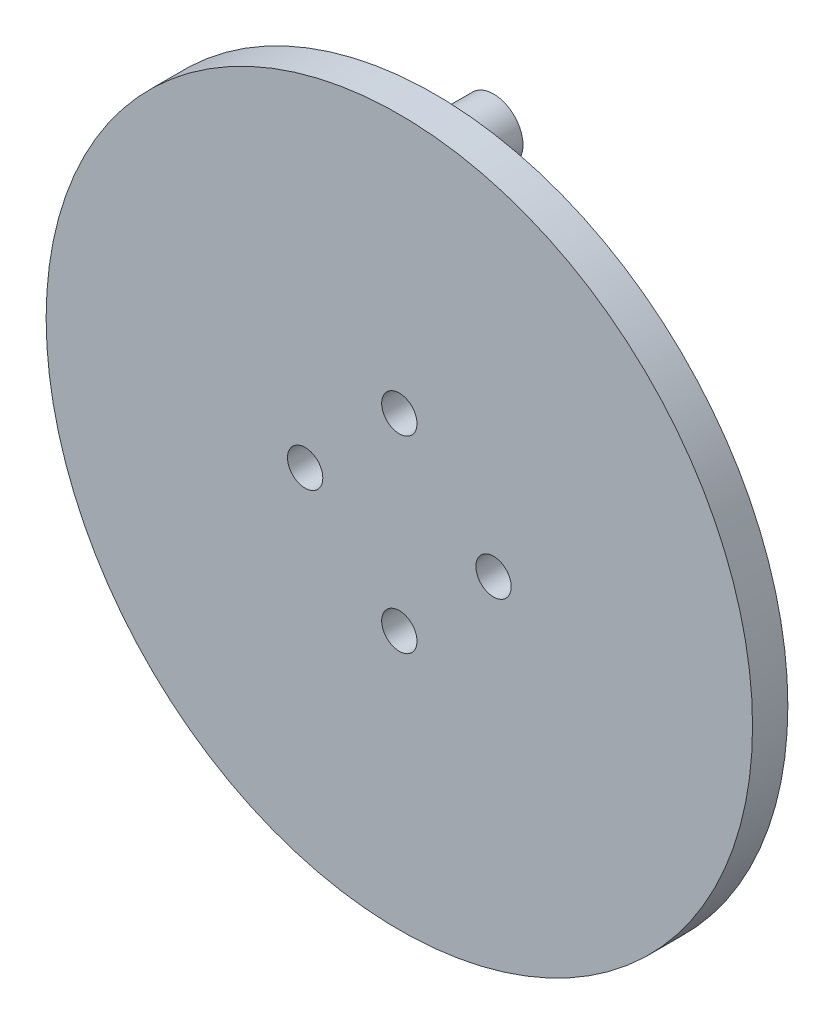
ISO-10303-21;
HEADER;
FILE_DESCRIPTION(('STEP AP214'),'2;1');
FILE_NAME('part.step','',(''),(''),'','','');
FILE_SCHEMA(('AUTOMOTIVE_DESIGN { 1 0 10303 214 1 1 1 1 }'));
ENDSEC;
DATA;
#1=APPLICATION_CONTEXT('core data for automotive mechanical design processes');
#2=APPLICATION_PROTOCOL_DEFINITION('international standard','automotive_design',2000,#1);
#3=PRODUCT_CONTEXT('',#1,'mechanical');
#4=PRODUCT('Part','Part','',(#3));
#5=PRODUCT_RELATED_PRODUCT_CATEGORY('part','',(#4));
#6=PRODUCT_DEFINITION_FORMATION('','',#4);
#7=PRODUCT_DEFINITION_CONTEXT('part definition',#1,'design');
#8=PRODUCT_DEFINITION('design','',#6,#7);
#9=PRODUCT_DEFINITION_SHAPE('','',#8);
#10=(LENGTH_UNIT() NAMED_UNIT(*) SI_UNIT(.MILLI.,.METRE.));
#11=(NAMED_UNIT(*) PLANE_ANGLE_UNIT() SI_UNIT($,.RADIAN.));
#12=(NAMED_UNIT(*) SI_UNIT($,.STERADIAN.) SOLID_ANGLE_UNIT());
#13=UNCERTAINTY_MEASURE_WITH_UNIT(LENGTH_MEASURE(1.E-05),#10,'distance_accuracy_value','');
#14=(GEOMETRIC_REPRESENTATION_CONTEXT(3) GLOBAL_UNCERTAINTY_ASSIGNED_CONTEXT((#13)) GLOBAL_UNIT_ASSIGNED_CONTEXT((#10,
#11,#12)) REPRESENTATION_CONTEXT('',''));
#15=CARTESIAN_POINT('',(0.,0.,0.));
#16=DIRECTION('',(0.,0.,1.));
#17=DIRECTION('',(1.,0.,0.));
#18=AXIS2_PLACEMENT_3D('',#15,#16,#17);
#19=CARTESIAN_POINT('',(0.,0.,3.));
#20=DIRECTION('',(0.,0.,1.));
#21=DIRECTION('',(1.,0.,0.));
#22=AXIS2_PLACEMENT_3D('',#19,#20,#21);
#23=PLANE('',#22);
#24=CARTESIAN_POINT('',(0.,-8.,3.));
#25=DIRECTION('',(0.,0.,1.));
#26=DIRECTION('',(1.,0.,0.));
#27=AXIS2_PLACEMENT_3D('',#24,#25,#26);
#28=CIRCLE('',#27,1.5);
#29=CARTESIAN_POINT('',(1.49999999999992,-8.,3.));
#30=VERTEX_POINT('',#29);
#31=EDGE_CURVE('E87',#30,#30,#28,.T.);
#32=ORIENTED_EDGE('',*,*,#31,.F.);
#33=EDGE_LOOP('',(#32));
#34=FACE_BOUND('',#33,.T.);
#35=CARTESIAN_POINT('',(0.,8.,3.));
#36=DIRECTION('',(0.,0.,1.));
#37=DIRECTION('',(1.,0.,0.));
#38=AXIS2_PLACEMENT_3D('',#35,#36,#37);
#39=CIRCLE('',#38,1.5);
#40=CARTESIAN_POINT('',(1.50000000000003,8.,3.));
#41=VERTEX_POINT('',#40);
#42=EDGE_CURVE('E76',#41,#41,#39,.T.);
#43=ORIENTED_EDGE('',*,*,#42,.F.);
#44=EDGE_LOOP('',(#43));
#45=FACE_BOUND('',#44,.T.);
#46=CARTESIAN_POINT('',(0.,0.,3.));
#47=DIRECTION('',(0.,0.,1.));
#48=DIRECTION('',(1.,0.,0.));
#49=AXIS2_PLACEMENT_3D('',#46,#47,#48);
#50=CIRCLE('',#49,30.);
#51=CARTESIAN_POINT('',(30.,0.,3.));
#52=VERTEX_POINT('',#51);
#53=EDGE_CURVE('E67',#52,#52,#50,.T.);
#54=ORIENTED_EDGE('',*,*,#53,.T.);
#55=EDGE_LOOP('',(#54));
#56=FACE_BOUND('',#55,.T.);
#57=CARTESIAN_POINT('',(8.,0.,3.));
#58=DIRECTION('',(0.,0.,1.));
#59=DIRECTION('',(1.,0.,0.));
#60=AXIS2_PLACEMENT_3D('',#57,#58,#59);
#61=CIRCLE('',#60,1.5);
#62=CARTESIAN_POINT('',(9.5,0.,3.));
#63=VERTEX_POINT('',#62);
#64=EDGE_CURVE('E81',#63,#63,#61,.T.);
#65=ORIENTED_EDGE('',*,*,#64,.F.);
#66=EDGE_LOOP('',(#65));
#67=FACE_BOUND('',#66,.T.);
#68=CARTESIAN_POINT('',(-8.,0.,3.));
#69=DIRECTION('',(0.,0.,1.));
#70=DIRECTION('',(1.,0.,0.));
#71=AXIS2_PLACEMENT_3D('',#68,#69,#70);
#72=CIRCLE('',#71,1.5);
#73=CARTESIAN_POINT('',(-6.5,0.,3.));
#74=VERTEX_POINT('',#73);
#75=EDGE_CURVE('E93',#74,#74,#72,.T.);
#76=ORIENTED_EDGE('',*,*,#75,.F.);
#77=EDGE_LOOP('',(#76));
#78=FACE_BOUND('',#77,.T.);
#79=ADVANCED_FACE('F60',(#34,#45,#56,#67,#78),#23,.T.);
#80=CARTESIAN_POINT('',(0.,0.,0.));
#81=DIRECTION('',(0.,0.,1.));
#82=DIRECTION('',(1.,0.,0.));
#83=AXIS2_PLACEMENT_3D('',#80,#81,#82);
#84=PLANE('',#83);
#85=CARTESIAN_POINT('',(0.,25.,0.));
#86=DIRECTION('',(0.,0.,1.));
#87=DIRECTION('',(1.,0.,0.));
#88=AXIS2_PLACEMENT_3D('',#85,#86,#87);
#89=CIRCLE('',#88,2.5);
#90=CARTESIAN_POINT('',(2.5,25.,0.));
#91=VERTEX_POINT('',#90);
#92=EDGE_CURVE('E11',#91,#91,#89,.F.);
#93=ORIENTED_EDGE('',*,*,#92,.F.);
#94=EDGE_LOOP('',(#93));
#95=FACE_BOUND('',#94,.T.);
#96=CARTESIAN_POINT('',(0.,0.,0.));
#97=DIRECTION('',(0.,0.,1.));
#98=DIRECTION('',(1.,0.,0.));
#99=AXIS2_PLACEMENT_3D('',#96,#97,#98);
#100=CIRCLE('',#99,30.);
#101=CARTESIAN_POINT('',(30.,0.,0.));
#102=VERTEX_POINT('',#101);
#103=EDGE_CURVE('E71',#102,#102,#100,.T.);
#104=ORIENTED_EDGE('',*,*,#103,.F.);
#105=EDGE_LOOP('',(#104));
#106=FACE_BOUND('',#105,.T.);
#107=CARTESIAN_POINT('',(0.,8.,0.));
#108=DIRECTION('',(0.,0.,1.));
#109=DIRECTION('',(1.,0.,0.));
#110=AXIS2_PLACEMENT_3D('',#107,#108,#109);
#111=CIRCLE('',#110,1.5);
#112=CARTESIAN_POINT('',(1.50000000000003,8.,0.));
#113=VERTEX_POINT('',#112);
#114=EDGE_CURVE('E78',#113,#113,#111,.T.);
#115=ORIENTED_EDGE('',*,*,#114,.T.);
#116=EDGE_LOOP('',(#115));
#117=FACE_BOUND('',#116,.T.);
#118=CARTESIAN_POINT('',(8.,0.,0.));
#119=DIRECTION('',(0.,0.,1.));
#120=DIRECTION('',(1.,0.,0.));
#121=AXIS2_PLACEMENT_3D('',#118,#119,#120);
#122=CIRCLE('',#121,1.5);
#123=CARTESIAN_POINT('',(9.5,0.,0.));
#124=VERTEX_POINT('',#123);
#125=EDGE_CURVE('E84',#124,#124,#122,.T.);
#126=ORIENTED_EDGE('',*,*,#125,.T.);
#127=EDGE_LOOP('',(#126));
#128=FACE_BOUND('',#127,.T.);
#129=CARTESIAN_POINT('',(0.,-8.,0.));
#130=DIRECTION('',(0.,0.,1.));
#131=DIRECTION('',(1.,0.,0.));
#132=AXIS2_PLACEMENT_3D('',#129,#130,#131);
#133=CIRCLE('',#132,1.5);
#134=CARTESIAN_POINT('',(1.49999999999992,-8.,0.));
#135=VERTEX_POINT('',#134);
#136=EDGE_CURVE('E90',#135,#135,#133,.T.);
#137=ORIENTED_EDGE('',*,*,#136,.T.);
#138=EDGE_LOOP('',(#137));
#139=FACE_BOUND('',#138,.T.);
#140=CARTESIAN_POINT('',(-8.,0.,0.));
#141=DIRECTION('',(0.,0.,1.));
#142=DIRECTION('',(1.,0.,0.));
#143=AXIS2_PLACEMENT_3D('',#140,#141,#142);
#144=CIRCLE('',#143,1.5);
#145=CARTESIAN_POINT('',(-6.5,0.,0.));
#146=VERTEX_POINT('',#145);
#147=EDGE_CURVE('E96',#146,#146,#144,.T.);
#148=ORIENTED_EDGE('',*,*,#147,.T.);
#149=EDGE_LOOP('',(#148));
#150=FACE_BOUND('',#149,.T.);
#151=ADVANCED_FACE('F120',(#95,#106,#117,#128,#139,#150),#84,.F.);
#152=CARTESIAN_POINT('',(0.,0.,3.));
#153=DIRECTION('',(0.,0.,-1.));
#154=DIRECTION('',(-1.,0.,0.));
#155=AXIS2_PLACEMENT_3D('',#152,#153,#154);
#156=CYLINDRICAL_SURFACE('',#155,30.);
#157=ORIENTED_EDGE('',*,*,#53,.F.);
#158=EDGE_LOOP('',(#157));
#159=FACE_BOUND('',#158,.T.);
#160=ORIENTED_EDGE('',*,*,#103,.T.);
#161=EDGE_LOOP('',(#160));
#162=FACE_BOUND('',#161,.T.);
#163=ADVANCED_FACE('F62',(#159,#162),#156,.T.);
#164=CARTESIAN_POINT('',(0.,8.,3.));
#165=DIRECTION('',(0.,0.,-1.));
#166=DIRECTION('',(-1.,0.,0.));
#167=AXIS2_PLACEMENT_3D('',#164,#165,#166);
#168=CYLINDRICAL_SURFACE('',#167,1.5);
#169=ORIENTED_EDGE('',*,*,#42,.T.);
#170=EDGE_LOOP('',(#169));
#171=FACE_BOUND('',#170,.T.);
#172=ORIENTED_EDGE('',*,*,#114,.F.);
#173=EDGE_LOOP('',(#172));
#174=FACE_BOUND('',#173,.T.);
#175=ADVANCED_FACE('F130',(#171,#174),#168,.F.);
#176=CARTESIAN_POINT('',(8.,0.,3.));
#177=DIRECTION('',(0.,0.,-1.));
#178=DIRECTION('',(-1.,0.,0.));
#179=AXIS2_PLACEMENT_3D('',#176,#177,#178);
#180=CYLINDRICAL_SURFACE('',#179,1.5);
#181=ORIENTED_EDGE('',*,*,#64,.T.);
#182=EDGE_LOOP('',(#181));
#183=FACE_BOUND('',#182,.T.);
#184=ORIENTED_EDGE('',*,*,#125,.F.);
#185=EDGE_LOOP('',(#184));
#186=FACE_BOUND('',#185,.T.);
#187=ADVANCED_FACE('F133',(#183,#186),#180,.F.);
#188=CARTESIAN_POINT('',(0.,-8.,3.));
#189=DIRECTION('',(0.,0.,-1.));
#190=DIRECTION('',(-1.,0.,0.));
#191=AXIS2_PLACEMENT_3D('',#188,#189,#190);
#192=CYLINDRICAL_SURFACE('',#191,1.5);
#193=ORIENTED_EDGE('',*,*,#31,.T.);
#194=EDGE_LOOP('',(#193));
#195=FACE_BOUND('',#194,.T.);
#196=ORIENTED_EDGE('',*,*,#136,.F.);
#197=EDGE_LOOP('',(#196));
#198=FACE_BOUND('',#197,.T.);
#199=ADVANCED_FACE('F116',(#195,#198),#192,.F.);
#200=CARTESIAN_POINT('',(-8.,0.,3.));
#201=DIRECTION('',(0.,0.,-1.));
#202=DIRECTION('',(-1.,0.,0.));
#203=AXIS2_PLACEMENT_3D('',#200,#201,#202);
#204=CYLINDRICAL_SURFACE('',#203,1.5);
#205=ORIENTED_EDGE('',*,*,#75,.T.);
#206=EDGE_LOOP('',(#205));
#207=FACE_BOUND('',#206,.T.);
#208=ORIENTED_EDGE('',*,*,#147,.F.);
#209=EDGE_LOOP('',(#208));
#210=FACE_BOUND('',#209,.T.);
#211=ADVANCED_FACE('F109',(#207,#210),#204,.F.);
#212=CARTESIAN_POINT('',(0.,25.,-5.));
#213=DIRECTION('',(0.,0.,1.));
#214=DIRECTION('',(1.,0.,0.));
#215=AXIS2_PLACEMENT_3D('',#212,#213,#214);
#216=CYLINDRICAL_SURFACE('',#215,2.5);
#217=CARTESIAN_POINT('',(0.,25.,-5.));
#218=DIRECTION('',(0.,0.,-1.));
#219=DIRECTION('',(-1.,0.,0.));
#220=AXIS2_PLACEMENT_3D('',#217,#218,#219);
#221=CIRCLE('',#220,2.5);
#222=CARTESIAN_POINT('',(-2.5,25.,-5.));
#223=VERTEX_POINT('',#222);
#224=EDGE_CURVE('E99',#223,#223,#221,.T.);
#225=ORIENTED_EDGE('',*,*,#224,.F.);
#226=EDGE_LOOP('',(#225));
#227=FACE_BOUND('',#226,.T.);
#228=ORIENTED_EDGE('',*,*,#92,.T.);
#229=EDGE_LOOP('',(#228));
#230=FACE_BOUND('',#229,.T.);
#231=ADVANCED_FACE('F107',(#227,#230),#216,.T.);
#232=CARTESIAN_POINT('',(0.,25.,-5.));
#233=DIRECTION('',(0.,0.,-1.));
#234=DIRECTION('',(-1.,0.,0.));
#235=AXIS2_PLACEMENT_3D('',#232,#233,#234);
#236=PLANE('',#235);
#237=ORIENTED_EDGE('',*,*,#224,.T.);
#238=EDGE_LOOP('',(#237));
#239=FACE_BOUND('',#238,.T.);
#240=ADVANCED_FACE('F105',(#239),#236,.T.);
#241=CLOSED_SHELL('',(#79,#151,#163,#175,#187,#199,#211,#231,#240));
#242=MANIFOLD_SOLID_BREP('B2',#241);
#243=ADVANCED_BREP_SHAPE_REPRESENTATION('',(#18,#242),#14);
#244=SHAPE_DEFINITION_REPRESENTATION(#9,#243);
ENDSEC;
END-ISO-10303-21;
